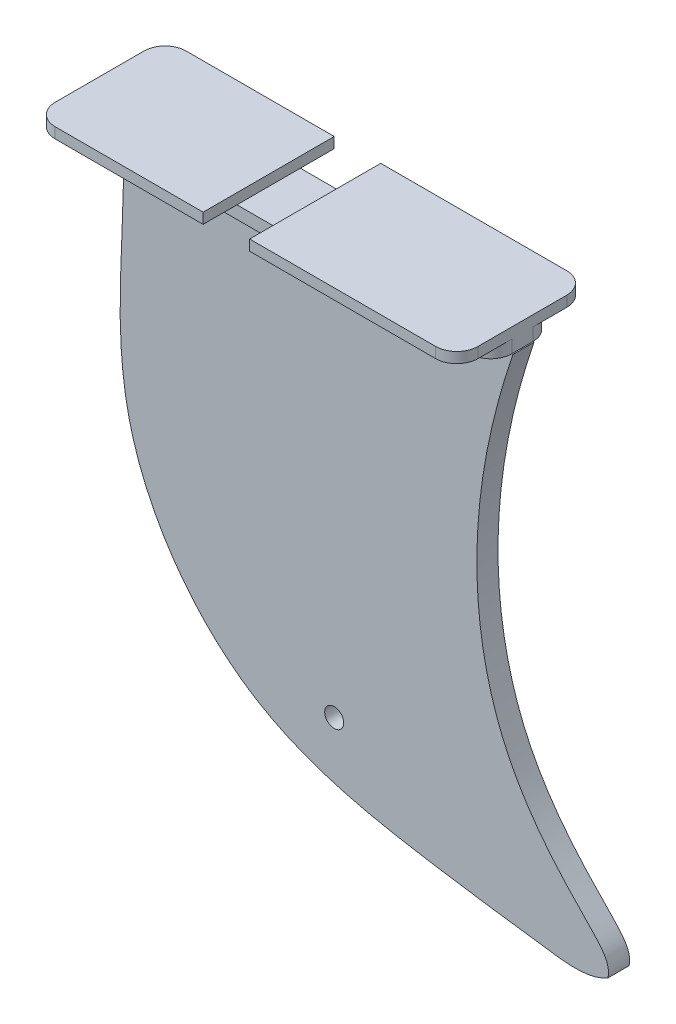
ISO-10303-21;
HEADER;
FILE_DESCRIPTION(('STEP AP214'),'2;1');
FILE_NAME('part.step','',(''),(''),'','','');
FILE_SCHEMA(('AUTOMOTIVE_DESIGN { 1 0 10303 214 1 1 1 1 }'));
ENDSEC;
DATA;
#1=APPLICATION_CONTEXT('core data for automotive mechanical design processes');
#2=APPLICATION_PROTOCOL_DEFINITION('international standard','automotive_design',2000,#1);
#3=PRODUCT_CONTEXT('',#1,'mechanical');
#4=PRODUCT('Part','Part','',(#3));
#5=PRODUCT_RELATED_PRODUCT_CATEGORY('part','',(#4));
#6=PRODUCT_DEFINITION_FORMATION('','',#4);
#7=PRODUCT_DEFINITION_CONTEXT('part definition',#1,'design');
#8=PRODUCT_DEFINITION('design','',#6,#7);
#9=PRODUCT_DEFINITION_SHAPE('','',#8);
#10=(LENGTH_UNIT() NAMED_UNIT(*) SI_UNIT(.MILLI.,.METRE.));
#11=(NAMED_UNIT(*) PLANE_ANGLE_UNIT() SI_UNIT($,.RADIAN.));
#12=(NAMED_UNIT(*) SI_UNIT($,.STERADIAN.) SOLID_ANGLE_UNIT());
#13=UNCERTAINTY_MEASURE_WITH_UNIT(LENGTH_MEASURE(1.E-05),#10,'distance_accuracy_value','');
#14=(GEOMETRIC_REPRESENTATION_CONTEXT(3) GLOBAL_UNCERTAINTY_ASSIGNED_CONTEXT((#13)) GLOBAL_UNIT_ASSIGNED_CONTEXT((#10,
#11,#12)) REPRESENTATION_CONTEXT('',''));
#15=CARTESIAN_POINT('',(0.,0.,0.));
#16=DIRECTION('',(0.,0.,1.));
#17=DIRECTION('',(1.,0.,0.));
#18=AXIS2_PLACEMENT_3D('',#15,#16,#17);
#19=CARTESIAN_POINT('',(-50.,2.5,-15.5));
#20=DIRECTION('',(0.,0.,1.));
#21=DIRECTION('',(1.,0.,0.));
#22=AXIS2_PLACEMENT_3D('',#19,#20,#21);
#23=PLANE('',#22);
#24=DIRECTION('',(-1.,0.,0.));
#25=VECTOR('',#24,1.);
#26=CARTESIAN_POINT('',(-50.,2.5,-15.5));
#27=LINE('',#26,#25);
#28=CARTESIAN_POINT('',(-10.,2.5,-15.5));
#29=VERTEX_POINT('',#28);
#30=CARTESIAN_POINT('',(-45.,2.5,-15.5));
#31=VERTEX_POINT('',#30);
#32=EDGE_CURVE('E222',#29,#31,#27,.T.);
#33=ORIENTED_EDGE('',*,*,#32,.F.);
#34=DIRECTION('',(0.,-1.,0.));
#35=VECTOR('',#34,1.);
#36=CARTESIAN_POINT('',(-10.,2.5,-15.5));
#37=LINE('',#36,#35);
#38=CARTESIAN_POINT('',(-10.,0.,-15.5));
#39=VERTEX_POINT('',#38);
#40=EDGE_CURVE('E205',#29,#39,#37,.T.);
#41=ORIENTED_EDGE('',*,*,#40,.T.);
#42=DIRECTION('',(-1.,0.,0.));
#43=VECTOR('',#42,1.);
#44=CARTESIAN_POINT('',(-50.,0.,-15.5));
#45=LINE('',#44,#43);
#46=CARTESIAN_POINT('',(-45.,0.,-15.5));
#47=VERTEX_POINT('',#46);
#48=EDGE_CURVE('E220',#39,#47,#45,.T.);
#49=ORIENTED_EDGE('',*,*,#48,.T.);
#50=DIRECTION('',(0.,-1.,0.));
#51=VECTOR('',#50,1.);
#52=CARTESIAN_POINT('',(-45.,2.5,-15.5));
#53=LINE('',#52,#51);
#54=EDGE_CURVE('E328',#47,#31,#53,.F.);
#55=ORIENTED_EDGE('',*,*,#54,.T.);
#56=EDGE_LOOP('',(#33,#41,#49,#55));
#57=FACE_BOUND('',#56,.T.);
#58=ADVANCED_FACE('F38',(#57),#23,.F.);
#59=CARTESIAN_POINT('',(-50.,2.5,15.5));
#60=DIRECTION('',(0.,0.,-1.));
#61=DIRECTION('',(-1.,0.,0.));
#62=AXIS2_PLACEMENT_3D('',#59,#60,#61);
#63=PLANE('',#62);
#64=DIRECTION('',(1.,0.,0.));
#65=VECTOR('',#64,1.);
#66=CARTESIAN_POINT('',(-50.,0.,15.5));
#67=LINE('',#66,#65);
#68=CARTESIAN_POINT('',(-45.,0.,15.5));
#69=VERTEX_POINT('',#68);
#70=CARTESIAN_POINT('',(-10.,0.,15.5));
#71=VERTEX_POINT('',#70);
#72=EDGE_CURVE('E248',#69,#71,#67,.T.);
#73=ORIENTED_EDGE('',*,*,#72,.T.);
#74=DIRECTION('',(0.,-1.,0.));
#75=VECTOR('',#74,1.);
#76=CARTESIAN_POINT('',(-10.,2.5,15.5));
#77=LINE('',#76,#75);
#78=CARTESIAN_POINT('',(-10.,2.5,15.5));
#79=VERTEX_POINT('',#78);
#80=EDGE_CURVE('E472',#79,#71,#77,.T.);
#81=ORIENTED_EDGE('',*,*,#80,.F.);
#82=DIRECTION('',(1.,0.,0.));
#83=VECTOR('',#82,1.);
#84=CARTESIAN_POINT('',(-50.,2.5,15.5));
#85=LINE('',#84,#83);
#86=CARTESIAN_POINT('',(-45.,2.5,15.5));
#87=VERTEX_POINT('',#86);
#88=EDGE_CURVE('E257',#87,#79,#85,.T.);
#89=ORIENTED_EDGE('',*,*,#88,.F.);
#90=DIRECTION('',(0.,-1.,0.));
#91=VECTOR('',#90,1.);
#92=CARTESIAN_POINT('',(-45.,2.5,15.5));
#93=LINE('',#92,#91);
#94=EDGE_CURVE('E281',#87,#69,#93,.T.);
#95=ORIENTED_EDGE('',*,*,#94,.T.);
#96=EDGE_LOOP('',(#73,#81,#89,#95));
#97=FACE_BOUND('',#96,.T.);
#98=ADVANCED_FACE('F548',(#97),#63,.F.);
#99=CARTESIAN_POINT('',(0.,2.5,0.));
#100=DIRECTION('',(0.,-1.,0.));
#101=DIRECTION('',(0.,0.,-1.));
#102=AXIS2_PLACEMENT_3D('',#99,#100,#101);
#103=PLANE('',#102);
#104=ORIENTED_EDGE('',*,*,#88,.T.);
#105=DIRECTION('',(0.,0.,1.));
#106=VECTOR('',#105,1.);
#107=CARTESIAN_POINT('',(-10.,2.5,-15.5));
#108=LINE('',#107,#106);
#109=EDGE_CURVE('E477',#29,#79,#108,.T.);
#110=ORIENTED_EDGE('',*,*,#109,.F.);
#111=ORIENTED_EDGE('',*,*,#32,.T.);
#112=CARTESIAN_POINT('',(-45.,2.5,-10.5));
#113=DIRECTION('',(0.,-1.,0.));
#114=DIRECTION('',(0.,0.,-1.));
#115=AXIS2_PLACEMENT_3D('',#112,#113,#114);
#116=CIRCLE('',#115,5.);
#117=CARTESIAN_POINT('',(-50.,2.5,-10.5));
#118=VERTEX_POINT('',#117);
#119=EDGE_CURVE('E292',#31,#118,#116,.F.);
#120=ORIENTED_EDGE('',*,*,#119,.T.);
#121=DIRECTION('',(0.,0.,1.));
#122=VECTOR('',#121,1.);
#123=CARTESIAN_POINT('',(-50.,2.5,15.5));
#124=LINE('',#123,#122);
#125=CARTESIAN_POINT('',(-50.,2.5,10.5));
#126=VERTEX_POINT('',#125);
#127=EDGE_CURVE('E408',#118,#126,#124,.T.);
#128=ORIENTED_EDGE('',*,*,#127,.T.);
#129=CARTESIAN_POINT('',(-45.,2.5,10.5));
#130=DIRECTION('',(0.,-1.,0.));
#131=DIRECTION('',(0.,0.,-1.));
#132=AXIS2_PLACEMENT_3D('',#129,#130,#131);
#133=CIRCLE('',#132,5.);
#134=EDGE_CURVE('E289',#126,#87,#133,.F.);
#135=ORIENTED_EDGE('',*,*,#134,.T.);
#136=EDGE_LOOP('',(#104,#110,#111,#120,#128,#135));
#137=FACE_BOUND('',#136,.T.);
#138=ADVANCED_FACE('F542',(#137),#103,.F.);
#139=CARTESIAN_POINT('',(0.,0.,0.));
#140=DIRECTION('',(0.,-1.,0.));
#141=DIRECTION('',(0.,0.,-1.));
#142=AXIS2_PLACEMENT_3D('',#139,#140,#141);
#143=PLANE('',#142);
#144=DIRECTION('',(0.,0.,1.));
#145=VECTOR('',#144,1.);
#146=CARTESIAN_POINT('',(-10.,0.,-15.5));
#147=LINE('',#146,#145);
#148=CARTESIAN_POINT('',(-10.,0.,7.49999999999999));
#149=VERTEX_POINT('',#148);
#150=EDGE_CURVE('E216',#149,#71,#147,.T.);
#151=ORIENTED_EDGE('',*,*,#150,.T.);
#152=ORIENTED_EDGE('',*,*,#72,.F.);
#153=CARTESIAN_POINT('',(-45.,0.,10.5));
#154=DIRECTION('',(0.,-1.,0.));
#155=DIRECTION('',(0.,0.,-1.));
#156=AXIS2_PLACEMENT_3D('',#153,#154,#155);
#157=CIRCLE('',#156,5.);
#158=CARTESIAN_POINT('',(-50.,0.,10.5));
#159=VERTEX_POINT('',#158);
#160=EDGE_CURVE('E269',#69,#159,#157,.T.);
#161=ORIENTED_EDGE('',*,*,#160,.T.);
#162=DIRECTION('',(0.,0.,1.));
#163=VECTOR('',#162,1.);
#164=CARTESIAN_POINT('',(-50.,0.,15.5));
#165=LINE('',#164,#163);
#166=CARTESIAN_POINT('',(-50.,0.,-10.5));
#167=VERTEX_POINT('',#166);
#168=EDGE_CURVE('E239',#167,#159,#165,.T.);
#169=ORIENTED_EDGE('',*,*,#168,.F.);
#170=CARTESIAN_POINT('',(-45.,0.,-10.5));
#171=DIRECTION('',(0.,-1.,0.));
#172=DIRECTION('',(0.,0.,-1.));
#173=AXIS2_PLACEMENT_3D('',#170,#171,#172);
#174=CIRCLE('',#173,5.);
#175=EDGE_CURVE('E230',#167,#47,#174,.T.);
#176=ORIENTED_EDGE('',*,*,#175,.T.);
#177=ORIENTED_EDGE('',*,*,#48,.F.);
#178=CARTESIAN_POINT('',(-10.,0.,-7.49999999999999));
#179=VERTEX_POINT('',#178);
#180=EDGE_CURVE('E202',#39,#179,#147,.T.);
#181=ORIENTED_EDGE('',*,*,#180,.T.);
#182=DIRECTION('',(1.,0.,0.));
#183=VECTOR('',#182,1.);
#184=CARTESIAN_POINT('',(50.,0.,-7.49999999999999));
#185=LINE('',#184,#183);
#186=CARTESIAN_POINT('',(-37.,0.,-7.5));
#187=VERTEX_POINT('',#186);
#188=EDGE_CURVE('E361',#187,#179,#185,.T.);
#189=ORIENTED_EDGE('',*,*,#188,.F.);
#190=CARTESIAN_POINT('',(-37.,0.,-2.5));
#191=DIRECTION('',(0.,-1.,0.));
#192=DIRECTION('',(0.,0.,-1.));
#193=AXIS2_PLACEMENT_3D('',#190,#191,#192);
#194=CIRCLE('',#193,5.);
#195=CARTESIAN_POINT('',(-42.,0.,-2.5));
#196=VERTEX_POINT('',#195);
#197=EDGE_CURVE('E47',#187,#196,#194,.F.);
#198=ORIENTED_EDGE('',*,*,#197,.T.);
#199=DIRECTION('',(0.,0.,-1.));
#200=VECTOR('',#199,1.);
#201=CARTESIAN_POINT('',(-42.,0.,7.5));
#202=LINE('',#201,#200);
#203=CARTESIAN_POINT('',(-42.,0.,2.5));
#204=VERTEX_POINT('',#203);
#205=EDGE_CURVE('E360',#204,#196,#202,.T.);
#206=ORIENTED_EDGE('',*,*,#205,.F.);
#207=CARTESIAN_POINT('',(-37.,0.,2.5));
#208=DIRECTION('',(0.,-1.,0.));
#209=DIRECTION('',(0.,0.,-1.));
#210=AXIS2_PLACEMENT_3D('',#207,#208,#209);
#211=CIRCLE('',#210,5.);
#212=CARTESIAN_POINT('',(-37.,0.,7.5));
#213=VERTEX_POINT('',#212);
#214=EDGE_CURVE('E11',#204,#213,#211,.F.);
#215=ORIENTED_EDGE('',*,*,#214,.T.);
#216=DIRECTION('',(-1.,0.,0.));
#217=VECTOR('',#216,1.);
#218=CARTESIAN_POINT('',(50.,0.,7.49999999999999));
#219=LINE('',#218,#217);
#220=EDGE_CURVE('E395',#149,#213,#219,.T.);
#221=ORIENTED_EDGE('',*,*,#220,.F.);
#222=EDGE_LOOP('',(#151,#152,#161,#169,#176,#177,#181,#189,#198,#206,#215,#221));
#223=FACE_BOUND('',#222,.T.);
#224=ADVANCED_FACE('F228',(#223),#143,.T.);
#225=DIRECTION('',(0.,0.,1.));
#226=VECTOR('',#225,1.);
#227=CARTESIAN_POINT('',(1.,0.,-15.5));
#228=LINE('',#227,#226);
#229=CARTESIAN_POINT('',(1.,0.,-15.5));
#230=VERTEX_POINT('',#229);
#231=CARTESIAN_POINT('',(1.,0.,-7.49999999999999));
#232=VERTEX_POINT('',#231);
#233=EDGE_CURVE('E54',#230,#232,#228,.T.);
#234=ORIENTED_EDGE('',*,*,#233,.F.);
#235=CARTESIAN_POINT('',(45.,0.,-15.5));
#236=VERTEX_POINT('',#235);
#237=EDGE_CURVE('E233',#236,#230,#45,.T.);
#238=ORIENTED_EDGE('',*,*,#237,.F.);
#239=CARTESIAN_POINT('',(45.,0.,-10.5));
#240=DIRECTION('',(0.,-1.,0.));
#241=DIRECTION('',(0.,0.,-1.));
#242=AXIS2_PLACEMENT_3D('',#239,#240,#241);
#243=CIRCLE('',#242,5.);
#244=CARTESIAN_POINT('',(50.,0.,-10.5));
#245=VERTEX_POINT('',#244);
#246=EDGE_CURVE('E274',#236,#245,#243,.T.);
#247=ORIENTED_EDGE('',*,*,#246,.T.);
#248=DIRECTION('',(0.,0.,-1.));
#249=VECTOR('',#248,1.);
#250=CARTESIAN_POINT('',(50.,0.,15.5));
#251=LINE('',#250,#249);
#252=CARTESIAN_POINT('',(50.,0.,-2.49999999999999));
#253=VERTEX_POINT('',#252);
#254=EDGE_CURVE('E240',#253,#245,#251,.T.);
#255=ORIENTED_EDGE('',*,*,#254,.F.);
#256=CARTESIAN_POINT('',(45.,0.,-2.49999999999999));
#257=DIRECTION('',(0.,-1.,0.));
#258=DIRECTION('',(0.,0.,-1.));
#259=AXIS2_PLACEMENT_3D('',#256,#257,#258);
#260=CIRCLE('',#259,5.);
#261=CARTESIAN_POINT('',(45.,0.,-7.49999999999999));
#262=VERTEX_POINT('',#261);
#263=EDGE_CURVE('E354',#253,#262,#260,.F.);
#264=ORIENTED_EDGE('',*,*,#263,.T.);
#265=EDGE_CURVE('E371',#232,#262,#185,.T.);
#266=ORIENTED_EDGE('',*,*,#265,.F.);
#267=EDGE_LOOP('',(#234,#238,#247,#255,#264,#266));
#268=FACE_BOUND('',#267,.T.);
#269=ADVANCED_FACE('F456',(#268),#143,.T.);
#270=CARTESIAN_POINT('',(0.,-3.,0.));
#271=DIRECTION('',(0.,1.,0.));
#272=DIRECTION('',(0.,0.,1.));
#273=AXIS2_PLACEMENT_3D('',#270,#271,#272);
#274=PLANE('',#273);
#275=DIRECTION('',(-1.,0.,0.));
#276=VECTOR('',#275,1.);
#277=CARTESIAN_POINT('',(50.2686737770654,-3.,2.5));
#278=LINE('',#277,#276);
#279=CARTESIAN_POINT('',(50.,-3.,2.5));
#280=VERTEX_POINT('',#279);
#281=CARTESIAN_POINT('',(-42.,-3.00000000000001,2.5));
#282=VERTEX_POINT('',#281);
#283=EDGE_CURVE('E513',#280,#282,#278,.T.);
#284=ORIENTED_EDGE('',*,*,#283,.F.);
#285=CARTESIAN_POINT('',(45.,-3.,2.49999999999999));
#286=DIRECTION('',(0.,1.,0.));
#287=DIRECTION('',(0.,0.,1.));
#288=AXIS2_PLACEMENT_3D('',#285,#286,#287);
#289=CIRCLE('',#288,5.);
#290=CARTESIAN_POINT('',(45.,-3.,7.49999999999999));
#291=VERTEX_POINT('',#290);
#292=EDGE_CURVE('E319',#280,#291,#289,.F.);
#293=ORIENTED_EDGE('',*,*,#292,.T.);
#294=DIRECTION('',(-1.,0.,0.));
#295=VECTOR('',#294,1.);
#296=CARTESIAN_POINT('',(50.,-3.,7.49999999999999));
#297=LINE('',#296,#295);
#298=CARTESIAN_POINT('',(-37.,-3.,7.5));
#299=VERTEX_POINT('',#298);
#300=EDGE_CURVE('E389',#291,#299,#297,.T.);
#301=ORIENTED_EDGE('',*,*,#300,.T.);
#302=CARTESIAN_POINT('',(-37.,-3.,2.5));
#303=DIRECTION('',(0.,1.,0.));
#304=DIRECTION('',(0.,0.,1.));
#305=AXIS2_PLACEMENT_3D('',#302,#303,#304);
#306=CIRCLE('',#305,5.);
#307=EDGE_CURVE('E308',#299,#282,#306,.F.);
#308=ORIENTED_EDGE('',*,*,#307,.T.);
#309=EDGE_LOOP('',(#284,#293,#301,#308));
#310=FACE_BOUND('',#309,.T.);
#311=ADVANCED_FACE('F531',(#310),#274,.F.);
#312=CARTESIAN_POINT('',(50.,2.5,15.5));
#313=DIRECTION('',(-1.,0.,0.));
#314=DIRECTION('',(0.,0.,1.));
#315=AXIS2_PLACEMENT_3D('',#312,#313,#314);
#316=PLANE('',#315);
#317=DIRECTION('',(0.,0.,-1.));
#318=VECTOR('',#317,1.);
#319=CARTESIAN_POINT('',(50.,2.5,15.5));
#320=LINE('',#319,#318);
#321=CARTESIAN_POINT('',(50.,2.5,10.5));
#322=VERTEX_POINT('',#321);
#323=CARTESIAN_POINT('',(50.,2.5,-10.5));
#324=VERTEX_POINT('',#323);
#325=EDGE_CURVE('E252',#322,#324,#320,.T.);
#326=ORIENTED_EDGE('',*,*,#325,.F.);
#327=DIRECTION('',(0.,-1.,0.));
#328=VECTOR('',#327,1.);
#329=CARTESIAN_POINT('',(50.,2.5,10.5));
#330=LINE('',#329,#328);
#331=CARTESIAN_POINT('',(50.,0.,10.5));
#332=VERTEX_POINT('',#331);
#333=EDGE_CURVE('E265',#322,#332,#330,.T.);
#334=ORIENTED_EDGE('',*,*,#333,.T.);
#335=CARTESIAN_POINT('',(50.,0.,2.49999999999999));
#336=VERTEX_POINT('',#335);
#337=EDGE_CURVE('E234',#332,#336,#251,.T.);
#338=ORIENTED_EDGE('',*,*,#337,.T.);
#339=DIRECTION('',(0.,1.,0.));
#340=VECTOR('',#339,1.);
#341=CARTESIAN_POINT('',(50.,2.5,2.49999999999999));
#342=LINE('',#341,#340);
#343=EDGE_CURVE('E261',#336,#280,#342,.F.);
#344=ORIENTED_EDGE('',*,*,#343,.T.);
#345=DIRECTION('',(0.,0.,1.));
#346=VECTOR('',#345,1.);
#347=CARTESIAN_POINT('',(50.,-3.,7.49999999999999));
#348=LINE('',#347,#346);
#349=CARTESIAN_POINT('',(50.,-3.,-2.5));
#350=VERTEX_POINT('',#349);
#351=EDGE_CURVE('E399',#350,#280,#348,.T.);
#352=ORIENTED_EDGE('',*,*,#351,.F.);
#353=DIRECTION('',(0.,1.,0.));
#354=VECTOR('',#353,1.);
#355=CARTESIAN_POINT('',(50.,2.5,-2.49999999999999));
#356=LINE('',#355,#354);
#357=EDGE_CURVE('E256',#350,#253,#356,.T.);
#358=ORIENTED_EDGE('',*,*,#357,.T.);
#359=ORIENTED_EDGE('',*,*,#254,.T.);
#360=DIRECTION('',(0.,-1.,0.));
#361=VECTOR('',#360,1.);
#362=CARTESIAN_POINT('',(50.,2.5,-10.5));
#363=LINE('',#362,#361);
#364=EDGE_CURVE('E253',#245,#324,#363,.F.);
#365=ORIENTED_EDGE('',*,*,#364,.T.);
#366=EDGE_LOOP('',(#326,#334,#338,#344,#352,#358,#359,#365));
#367=FACE_BOUND('',#366,.T.);
#368=ADVANCED_FACE('F434',(#367),#316,.F.);
#369=ORIENTED_EDGE('',*,*,#237,.T.);
#370=DIRECTION('',(0.,1.,0.));
#371=VECTOR('',#370,1.);
#372=CARTESIAN_POINT('',(0.999999999999997,2.5,-15.5));
#373=LINE('',#372,#371);
#374=CARTESIAN_POINT('',(0.999999999999997,2.5,-15.5));
#375=VERTEX_POINT('',#374);
#376=EDGE_CURVE('E224',#230,#375,#373,.T.);
#377=ORIENTED_EDGE('',*,*,#376,.T.);
#378=CARTESIAN_POINT('',(45.,2.5,-15.5));
#379=VERTEX_POINT('',#378);
#380=EDGE_CURVE('E404',#379,#375,#27,.T.);
#381=ORIENTED_EDGE('',*,*,#380,.F.);
#382=DIRECTION('',(0.,-1.,0.));
#383=VECTOR('',#382,1.);
#384=CARTESIAN_POINT('',(45.,2.5,-15.5));
#385=LINE('',#384,#383);
#386=EDGE_CURVE('E331',#379,#236,#385,.T.);
#387=ORIENTED_EDGE('',*,*,#386,.T.);
#388=EDGE_LOOP('',(#369,#377,#381,#387));
#389=FACE_BOUND('',#388,.T.);
#390=ADVANCED_FACE('F467',(#389),#23,.F.);
#391=CARTESIAN_POINT('',(-50.,2.5,15.5));
#392=DIRECTION('',(1.,0.,0.));
#393=DIRECTION('',(0.,0.,-1.));
#394=AXIS2_PLACEMENT_3D('',#391,#392,#393);
#395=PLANE('',#394);
#396=ORIENTED_EDGE('',*,*,#127,.F.);
#397=DIRECTION('',(0.,-1.,0.));
#398=VECTOR('',#397,1.);
#399=CARTESIAN_POINT('',(-50.,2.5,-10.5));
#400=LINE('',#399,#398);
#401=EDGE_CURVE('E338',#118,#167,#400,.T.);
#402=ORIENTED_EDGE('',*,*,#401,.T.);
#403=ORIENTED_EDGE('',*,*,#168,.T.);
#404=DIRECTION('',(0.,-1.,0.));
#405=VECTOR('',#404,1.);
#406=CARTESIAN_POINT('',(-50.,2.5,10.5));
#407=LINE('',#406,#405);
#408=EDGE_CURVE('E335',#159,#126,#407,.F.);
#409=ORIENTED_EDGE('',*,*,#408,.T.);
#410=EDGE_LOOP('',(#396,#402,#403,#409));
#411=FACE_BOUND('',#410,.T.);
#412=ADVANCED_FACE('F547',(#411),#395,.F.);
#413=CARTESIAN_POINT('',(0.999999999999997,2.5,15.5));
#414=VERTEX_POINT('',#413);
#415=CARTESIAN_POINT('',(45.,2.5,15.5));
#416=VERTEX_POINT('',#415);
#417=EDGE_CURVE('E411',#414,#416,#85,.T.);
#418=ORIENTED_EDGE('',*,*,#417,.F.);
#419=DIRECTION('',(0.,1.,0.));
#420=VECTOR('',#419,1.);
#421=CARTESIAN_POINT('',(0.999999999999997,2.5,15.5));
#422=LINE('',#421,#420);
#423=CARTESIAN_POINT('',(1.,0.,15.5));
#424=VERTEX_POINT('',#423);
#425=EDGE_CURVE('E225',#424,#414,#422,.T.);
#426=ORIENTED_EDGE('',*,*,#425,.F.);
#427=CARTESIAN_POINT('',(45.,0.,15.5));
#428=VERTEX_POINT('',#427);
#429=EDGE_CURVE('E247',#424,#428,#67,.T.);
#430=ORIENTED_EDGE('',*,*,#429,.T.);
#431=DIRECTION('',(0.,-1.,0.));
#432=VECTOR('',#431,1.);
#433=CARTESIAN_POINT('',(45.,2.5,15.5));
#434=LINE('',#433,#432);
#435=EDGE_CURVE('E285',#428,#416,#434,.F.);
#436=ORIENTED_EDGE('',*,*,#435,.T.);
#437=EDGE_LOOP('',(#418,#426,#430,#436));
#438=FACE_BOUND('',#437,.T.);
#439=ADVANCED_FACE('F427',(#438),#63,.F.);
#440=ORIENTED_EDGE('',*,*,#380,.T.);
#441=DIRECTION('',(0.,0.,1.));
#442=VECTOR('',#441,1.);
#443=CARTESIAN_POINT('',(0.999999999999997,2.5,-15.5));
#444=LINE('',#443,#442);
#445=EDGE_CURVE('E423',#375,#414,#444,.T.);
#446=ORIENTED_EDGE('',*,*,#445,.T.);
#447=ORIENTED_EDGE('',*,*,#417,.T.);
#448=CARTESIAN_POINT('',(45.,2.5,10.5));
#449=DIRECTION('',(0.,-1.,0.));
#450=DIRECTION('',(0.,0.,-1.));
#451=AXIS2_PLACEMENT_3D('',#448,#449,#450);
#452=CIRCLE('',#451,5.);
#453=EDGE_CURVE('E298',#416,#322,#452,.F.);
#454=ORIENTED_EDGE('',*,*,#453,.T.);
#455=ORIENTED_EDGE('',*,*,#325,.T.);
#456=CARTESIAN_POINT('',(45.,2.5,-10.5));
#457=DIRECTION('',(0.,-1.,0.));
#458=DIRECTION('',(0.,0.,-1.));
#459=AXIS2_PLACEMENT_3D('',#456,#457,#458);
#460=CIRCLE('',#459,5.);
#461=EDGE_CURVE('E295',#324,#379,#460,.F.);
#462=ORIENTED_EDGE('',*,*,#461,.T.);
#463=EDGE_LOOP('',(#440,#446,#447,#454,#455,#462));
#464=FACE_BOUND('',#463,.T.);
#465=ADVANCED_FACE('F420',(#464),#103,.F.);
#466=CARTESIAN_POINT('',(1.,0.,7.49999999999999));
#467=VERTEX_POINT('',#466);
#468=EDGE_CURVE('E214',#467,#424,#228,.T.);
#469=ORIENTED_EDGE('',*,*,#468,.F.);
#470=CARTESIAN_POINT('',(45.,0.,7.49999999999999));
#471=VERTEX_POINT('',#470);
#472=EDGE_CURVE('E372',#471,#467,#219,.T.);
#473=ORIENTED_EDGE('',*,*,#472,.F.);
#474=CARTESIAN_POINT('',(45.,0.,2.49999999999999));
#475=DIRECTION('',(0.,-1.,0.));
#476=DIRECTION('',(0.,0.,-1.));
#477=AXIS2_PLACEMENT_3D('',#474,#475,#476);
#478=CIRCLE('',#477,5.);
#479=EDGE_CURVE('E350',#471,#336,#478,.F.);
#480=ORIENTED_EDGE('',*,*,#479,.T.);
#481=ORIENTED_EDGE('',*,*,#337,.F.);
#482=CARTESIAN_POINT('',(45.,0.,10.5));
#483=DIRECTION('',(0.,-1.,0.));
#484=DIRECTION('',(0.,0.,-1.));
#485=AXIS2_PLACEMENT_3D('',#482,#483,#484);
#486=CIRCLE('',#485,5.);
#487=EDGE_CURVE('E277',#332,#428,#486,.T.);
#488=ORIENTED_EDGE('',*,*,#487,.T.);
#489=ORIENTED_EDGE('',*,*,#429,.F.);
#490=EDGE_LOOP('',(#469,#473,#480,#481,#488,#489));
#491=FACE_BOUND('',#490,.T.);
#492=ADVANCED_FACE('F437',(#491),#143,.T.);
#493=CARTESIAN_POINT('',(50.,-3.,7.49999999999999));
#494=DIRECTION('',(0.,0.,-1.));
#495=DIRECTION('',(-1.,0.,0.));
#496=AXIS2_PLACEMENT_3D('',#493,#494,#495);
#497=PLANE('',#496);
#498=ORIENTED_EDGE('',*,*,#300,.F.);
#499=DIRECTION('',(0.,1.,0.));
#500=VECTOR('',#499,1.);
#501=CARTESIAN_POINT('',(45.,-3.,7.49999999999999));
#502=LINE('',#501,#500);
#503=EDGE_CURVE('E304',#291,#471,#502,.T.);
#504=ORIENTED_EDGE('',*,*,#503,.T.);
#505=ORIENTED_EDGE('',*,*,#472,.T.);
#506=DIRECTION('',(-1.,0.,0.));
#507=VECTOR('',#506,1.);
#508=CARTESIAN_POINT('',(50.,0.,7.49999999999999));
#509=LINE('',#508,#507);
#510=EDGE_CURVE('E480',#467,#149,#509,.T.);
#511=ORIENTED_EDGE('',*,*,#510,.T.);
#512=ORIENTED_EDGE('',*,*,#220,.T.);
#513=DIRECTION('',(0.,1.,0.));
#514=VECTOR('',#513,1.);
#515=CARTESIAN_POINT('',(-37.,-3.,7.5));
#516=LINE('',#515,#514);
#517=EDGE_CURVE('E301',#213,#299,#516,.F.);
#518=ORIENTED_EDGE('',*,*,#517,.T.);
#519=EDGE_LOOP('',(#498,#504,#505,#511,#512,#518));
#520=FACE_BOUND('',#519,.T.);
#521=ADVANCED_FACE('F536',(#520),#497,.F.);
#522=CARTESIAN_POINT('',(-42.,-3.,7.5));
#523=DIRECTION('',(1.,0.,0.));
#524=DIRECTION('',(0.,0.,-1.));
#525=AXIS2_PLACEMENT_3D('',#522,#523,#524);
#526=PLANE('',#525);
#527=ORIENTED_EDGE('',*,*,#205,.T.);
#528=DIRECTION('',(0.,1.,0.));
#529=VECTOR('',#528,1.);
#530=CARTESIAN_POINT('',(-42.,-3.,-2.5));
#531=LINE('',#530,#529);
#532=CARTESIAN_POINT('',(-42.,-3.,-2.5));
#533=VERTEX_POINT('',#532);
#534=EDGE_CURVE('E346',#196,#533,#531,.F.);
#535=ORIENTED_EDGE('',*,*,#534,.T.);
#536=DIRECTION('',(0.,0.,-1.));
#537=VECTOR('',#536,1.);
#538=CARTESIAN_POINT('',(-42.,-3.,7.5));
#539=LINE('',#538,#537);
#540=EDGE_CURVE('E383',#282,#533,#539,.T.);
#541=ORIENTED_EDGE('',*,*,#540,.F.);
#542=DIRECTION('',(0.,1.,0.));
#543=VECTOR('',#542,1.);
#544=CARTESIAN_POINT('',(-42.,-3.,2.5));
#545=LINE('',#544,#543);
#546=EDGE_CURVE('E342',#282,#204,#545,.T.);
#547=ORIENTED_EDGE('',*,*,#546,.T.);
#548=EDGE_LOOP('',(#527,#535,#541,#547));
#549=FACE_BOUND('',#548,.T.);
#550=ADVANCED_FACE('F366',(#549),#526,.F.);
#551=CARTESIAN_POINT('',(50.,-3.,-7.49999999999999));
#552=DIRECTION('',(0.,0.,1.));
#553=DIRECTION('',(1.,0.,0.));
#554=AXIS2_PLACEMENT_3D('',#551,#552,#553);
#555=PLANE('',#554);
#556=ORIENTED_EDGE('',*,*,#188,.T.);
#557=EDGE_CURVE('E400',#179,#232,#185,.T.);
#558=ORIENTED_EDGE('',*,*,#557,.T.);
#559=ORIENTED_EDGE('',*,*,#265,.T.);
#560=DIRECTION('',(0.,1.,0.));
#561=VECTOR('',#560,1.);
#562=CARTESIAN_POINT('',(45.,-3.,-7.49999999999999));
#563=LINE('',#562,#561);
#564=CARTESIAN_POINT('',(45.,-3.,-7.49999999999999));
#565=VERTEX_POINT('',#564);
#566=EDGE_CURVE('E62',#262,#565,#563,.F.);
#567=ORIENTED_EDGE('',*,*,#566,.T.);
#568=DIRECTION('',(1.,0.,0.));
#569=VECTOR('',#568,1.);
#570=CARTESIAN_POINT('',(50.,-3.,-7.49999999999999));
#571=LINE('',#570,#569);
#572=CARTESIAN_POINT('',(-37.,-3.,-7.5));
#573=VERTEX_POINT('',#572);
#574=EDGE_CURVE('E378',#573,#565,#571,.T.);
#575=ORIENTED_EDGE('',*,*,#574,.F.);
#576=DIRECTION('',(0.,1.,0.));
#577=VECTOR('',#576,1.);
#578=CARTESIAN_POINT('',(-37.,-3.,-7.5));
#579=LINE('',#578,#577);
#580=EDGE_CURVE('E322',#573,#187,#579,.T.);
#581=ORIENTED_EDGE('',*,*,#580,.T.);
#582=EDGE_LOOP('',(#556,#558,#559,#567,#575,#581));
#583=FACE_BOUND('',#582,.T.);
#584=ADVANCED_FACE('F381',(#583),#555,.F.);
#585=CARTESIAN_POINT('',(45.,-3.,-2.49999999999999));
#586=DIRECTION('',(0.,1.,0.));
#587=DIRECTION('',(0.,0.,1.));
#588=AXIS2_PLACEMENT_3D('',#585,#586,#587);
#589=CIRCLE('',#588,5.);
#590=EDGE_CURVE('E315',#565,#350,#589,.F.);
#591=ORIENTED_EDGE('',*,*,#590,.T.);
#592=DIRECTION('',(-1.,0.,0.));
#593=VECTOR('',#592,1.);
#594=CARTESIAN_POINT('',(50.2686737770654,-3.,-2.5));
#595=LINE('',#594,#593);
#596=EDGE_CURVE('E380',#350,#533,#595,.T.);
#597=ORIENTED_EDGE('',*,*,#596,.T.);
#598=CARTESIAN_POINT('',(-37.,-3.,-2.5));
#599=DIRECTION('',(0.,1.,0.));
#600=DIRECTION('',(0.,0.,1.));
#601=AXIS2_PLACEMENT_3D('',#598,#599,#600);
#602=CIRCLE('',#601,5.);
#603=EDGE_CURVE('E312',#533,#573,#602,.F.);
#604=ORIENTED_EDGE('',*,*,#603,.T.);
#605=ORIENTED_EDGE('',*,*,#574,.T.);
#606=EDGE_LOOP('',(#591,#597,#604,#605));
#607=FACE_BOUND('',#606,.T.);
#608=ADVANCED_FACE('F377',(#607),#274,.F.);
#609=CARTESIAN_POINT('',(45.,2.5,10.5));
#610=DIRECTION('',(0.,-1.,0.));
#611=DIRECTION('',(0.,0.,-1.));
#612=AXIS2_PLACEMENT_3D('',#609,#610,#611);
#613=CYLINDRICAL_SURFACE('',#612,5.);
#614=ORIENTED_EDGE('',*,*,#453,.F.);
#615=ORIENTED_EDGE('',*,*,#435,.F.);
#616=ORIENTED_EDGE('',*,*,#487,.F.);
#617=ORIENTED_EDGE('',*,*,#333,.F.);
#618=EDGE_LOOP('',(#614,#615,#616,#617));
#619=FACE_BOUND('',#618,.T.);
#620=ADVANCED_FACE('F431',(#619),#613,.T.);
#621=CARTESIAN_POINT('',(45.,-3.,2.49999999999999));
#622=DIRECTION('',(0.,1.,0.));
#623=DIRECTION('',(0.,0.,1.));
#624=AXIS2_PLACEMENT_3D('',#621,#622,#623);
#625=CYLINDRICAL_SURFACE('',#624,5.);
#626=ORIENTED_EDGE('',*,*,#292,.F.);
#627=ORIENTED_EDGE('',*,*,#343,.F.);
#628=ORIENTED_EDGE('',*,*,#479,.F.);
#629=ORIENTED_EDGE('',*,*,#503,.F.);
#630=EDGE_LOOP('',(#626,#627,#628,#629));
#631=FACE_BOUND('',#630,.T.);
#632=ADVANCED_FACE('F443',(#631),#625,.T.);
#633=CARTESIAN_POINT('',(45.,2.5,-2.49999999999999));
#634=DIRECTION('',(0.,1.,0.));
#635=DIRECTION('',(0.,0.,1.));
#636=AXIS2_PLACEMENT_3D('',#633,#634,#635);
#637=CYLINDRICAL_SURFACE('',#636,5.);
#638=ORIENTED_EDGE('',*,*,#590,.F.);
#639=ORIENTED_EDGE('',*,*,#566,.F.);
#640=ORIENTED_EDGE('',*,*,#263,.F.);
#641=ORIENTED_EDGE('',*,*,#357,.F.);
#642=EDGE_LOOP('',(#638,#639,#640,#641));
#643=FACE_BOUND('',#642,.T.);
#644=ADVANCED_FACE('F453',(#643),#637,.T.);
#645=CARTESIAN_POINT('',(45.,2.5,-10.5));
#646=DIRECTION('',(0.,-1.,0.));
#647=DIRECTION('',(0.,0.,-1.));
#648=AXIS2_PLACEMENT_3D('',#645,#646,#647);
#649=CYLINDRICAL_SURFACE('',#648,5.);
#650=ORIENTED_EDGE('',*,*,#461,.F.);
#651=ORIENTED_EDGE('',*,*,#364,.F.);
#652=ORIENTED_EDGE('',*,*,#246,.F.);
#653=ORIENTED_EDGE('',*,*,#386,.F.);
#654=EDGE_LOOP('',(#650,#651,#652,#653));
#655=FACE_BOUND('',#654,.T.);
#656=ADVANCED_FACE('F462',(#655),#649,.T.);
#657=CARTESIAN_POINT('',(-45.,2.5,-10.5));
#658=DIRECTION('',(0.,-1.,0.));
#659=DIRECTION('',(0.,0.,-1.));
#660=AXIS2_PLACEMENT_3D('',#657,#658,#659);
#661=CYLINDRICAL_SURFACE('',#660,5.);
#662=ORIENTED_EDGE('',*,*,#119,.F.);
#663=ORIENTED_EDGE('',*,*,#54,.F.);
#664=ORIENTED_EDGE('',*,*,#175,.F.);
#665=ORIENTED_EDGE('',*,*,#401,.F.);
#666=EDGE_LOOP('',(#662,#663,#664,#665));
#667=FACE_BOUND('',#666,.T.);
#668=ADVANCED_FACE('F564',(#667),#661,.T.);
#669=CARTESIAN_POINT('',(-37.,-3.,-2.5));
#670=DIRECTION('',(0.,1.,0.));
#671=DIRECTION('',(0.,0.,1.));
#672=AXIS2_PLACEMENT_3D('',#669,#670,#671);
#673=CYLINDRICAL_SURFACE('',#672,5.);
#674=ORIENTED_EDGE('',*,*,#603,.F.);
#675=ORIENTED_EDGE('',*,*,#534,.F.);
#676=ORIENTED_EDGE('',*,*,#197,.F.);
#677=ORIENTED_EDGE('',*,*,#580,.F.);
#678=EDGE_LOOP('',(#674,#675,#676,#677));
#679=FACE_BOUND('',#678,.T.);
#680=ADVANCED_FACE('F374',(#679),#673,.T.);
#681=CARTESIAN_POINT('',(-37.,-3.,2.5));
#682=DIRECTION('',(0.,1.,0.));
#683=DIRECTION('',(0.,0.,1.));
#684=AXIS2_PLACEMENT_3D('',#681,#682,#683);
#685=CYLINDRICAL_SURFACE('',#684,5.);
#686=ORIENTED_EDGE('',*,*,#307,.F.);
#687=ORIENTED_EDGE('',*,*,#517,.F.);
#688=ORIENTED_EDGE('',*,*,#214,.F.);
#689=ORIENTED_EDGE('',*,*,#546,.F.);
#690=EDGE_LOOP('',(#686,#687,#688,#689));
#691=FACE_BOUND('',#690,.T.);
#692=ADVANCED_FACE('F569',(#691),#685,.T.);
#693=CARTESIAN_POINT('',(-45.,2.5,10.5));
#694=DIRECTION('',(0.,-1.,0.));
#695=DIRECTION('',(0.,0.,-1.));
#696=AXIS2_PLACEMENT_3D('',#693,#694,#695);
#697=CYLINDRICAL_SURFACE('',#696,5.);
#698=ORIENTED_EDGE('',*,*,#134,.F.);
#699=ORIENTED_EDGE('',*,*,#408,.F.);
#700=ORIENTED_EDGE('',*,*,#160,.F.);
#701=ORIENTED_EDGE('',*,*,#94,.F.);
#702=EDGE_LOOP('',(#698,#699,#700,#701));
#703=FACE_BOUND('',#702,.T.);
#704=ADVANCED_FACE('F40',(#703),#697,.T.);
#705=CARTESIAN_POINT('',(50.2686737770654,-3.,2.5));
#706=DIRECTION('',(0.,-1.,0.));
#707=DIRECTION('',(1.,0.,0.));
#708=AXIS2_PLACEMENT_3D('',#705,#706,#707);
#709=PLANE('',#708);
#710=CARTESIAN_POINT('',(50.2686737770654,-3.,-2.5));
#711=VERTEX_POINT('',#710);
#712=EDGE_CURVE('E600',#711,#350,#595,.T.);
#713=ORIENTED_EDGE('',*,*,#712,.T.);
#714=ORIENTED_EDGE('',*,*,#351,.T.);
#715=CARTESIAN_POINT('',(50.2686737770654,-3.,2.5));
#716=VERTEX_POINT('',#715);
#717=EDGE_CURVE('E515',#716,#280,#278,.T.);
#718=ORIENTED_EDGE('',*,*,#717,.F.);
#719=DIRECTION('',(0.,0.,-1.));
#720=VECTOR('',#719,1.);
#721=CARTESIAN_POINT('',(50.2686737770654,-3.,2.5));
#722=LINE('',#721,#720);
#723=EDGE_CURVE('E612',#716,#711,#722,.T.);
#724=ORIENTED_EDGE('',*,*,#723,.T.);
#725=EDGE_LOOP('',(#713,#714,#718,#724));
#726=FACE_BOUND('',#725,.T.);
#727=ADVANCED_FACE('F526',(#726),#709,.F.);
#728=CARTESIAN_POINT('',(72.7453190562339,-119.45797853805,2.5));
#729=CARTESIAN_POINT('',(73.5272978003636,-115.295050347708,2.5));
#730=CARTESIAN_POINT('',(67.8663834720424,-111.564174062994,2.5));
#731=CARTESIAN_POINT('',(40.8374136293946,-79.6561025630625,2.5));
#732=CARTESIAN_POINT('',(38.369873507686,-37.7895082874847,2.5));
#733=CARTESIAN_POINT('',(50.2686737770656,-2.9999999999996,2.5));
#734=B_SPLINE_CURVE_WITH_KNOTS('',3,(#728,#729,#730,#731,#732,#733),.UNSPECIFIED.,.F.,.F.,(4,1,
1,4),(0.,0.326988998162601,0.554852247940817,1.),.UNSPECIFIED.);
#735=DIRECTION('',(0.,0.,-1.));
#736=VECTOR('',#735,1.);
#737=SURFACE_OF_LINEAR_EXTRUSION('',#734,#736);
#738=CARTESIAN_POINT('',(72.7453190562339,-119.45797853805,-2.5));
#739=CARTESIAN_POINT('',(73.5272978003636,-115.295050347708,-2.5));
#740=CARTESIAN_POINT('',(67.8663834720424,-111.564174062994,-2.5));
#741=CARTESIAN_POINT('',(40.8374136293946,-79.6561025630625,-2.5));
#742=CARTESIAN_POINT('',(38.369873507686,-37.7895082874847,-2.5));
#743=CARTESIAN_POINT('',(50.2686737770656,-2.9999999999996,-2.5));
#744=B_SPLINE_CURVE_WITH_KNOTS('',3,(#738,#739,#740,#741,#742,#743),.UNSPECIFIED.,.F.,.F.,(4,1,
1,4),(0.,0.326988998162601,0.554852247940817,1.),.UNSPECIFIED.);
#745=CARTESIAN_POINT('',(72.7453190562339,-119.45797853805,-2.5));
#746=VERTEX_POINT('',#745);
#747=EDGE_CURVE('E494',#746,#711,#744,.T.);
#748=ORIENTED_EDGE('',*,*,#747,.T.);
#749=ORIENTED_EDGE('',*,*,#723,.F.);
#750=CARTESIAN_POINT('',(72.7453190562339,-119.45797853805,2.5));
#751=VERTEX_POINT('',#750);
#752=EDGE_CURVE('E506',#751,#716,#734,.T.);
#753=ORIENTED_EDGE('',*,*,#752,.F.);
#754=DIRECTION('',(0.,0.,-1.));
#755=VECTOR('',#754,1.);
#756=CARTESIAN_POINT('',(72.7453190562339,-119.45797853805,2.5));
#757=LINE('',#756,#755);
#758=EDGE_CURVE('E609',#751,#746,#757,.T.);
#759=ORIENTED_EDGE('',*,*,#758,.T.);
#760=EDGE_LOOP('',(#748,#749,#753,#759));
#761=FACE_BOUND('',#760,.T.);
#762=ADVANCED_FACE('F521',(#761),#737,.F.);
#763=CARTESIAN_POINT('',(-42.,-3.,2.5));
#764=CARTESIAN_POINT('',(-40.9085130635637,-23.2942870696618,2.5));
#765=CARTESIAN_POINT('',(-48.7762785630255,-61.4392414921328,2.5));
#766=CARTESIAN_POINT('',(-15.0116129030552,-108.496757752683,2.5));
#767=CARTESIAN_POINT('',(26.0912809830065,-116.271998862179,2.5));
#768=CARTESIAN_POINT('',(53.9217447207977,-120.172870923581,2.5));
#769=CARTESIAN_POINT('',(68.3309722556653,-122.076661228524,2.5));
#770=CARTESIAN_POINT('',(72.7453190562339,-119.45797853805,2.5));
#771=B_SPLINE_CURVE_WITH_KNOTS('',3,(#763,#764,#765,#766,#767,#768,#769,#770),.UNSPECIFIED.,.F.,
.F.,(4,1,1,1,1,4),(0.,0.313172426000175,0.56068679091605,0.787562365297058,0.924725025907323,
1.),.UNSPECIFIED.);
#772=DIRECTION('',(0.,0.,-1.));
#773=VECTOR('',#772,1.);
#774=SURFACE_OF_LINEAR_EXTRUSION('',#771,#773);
#775=CARTESIAN_POINT('',(-42.,-3.,-2.5));
#776=CARTESIAN_POINT('',(-40.9085130635637,-23.2942870696618,-2.5));
#777=CARTESIAN_POINT('',(-48.7762785630255,-61.4392414921328,-2.5));
#778=CARTESIAN_POINT('',(-15.0116129030552,-108.496757752683,-2.5));
#779=CARTESIAN_POINT('',(26.0912809830065,-116.271998862179,-2.5));
#780=CARTESIAN_POINT('',(53.9217447207977,-120.172870923581,-2.5));
#781=CARTESIAN_POINT('',(68.3309722556653,-122.076661228524,-2.5));
#782=CARTESIAN_POINT('',(72.7453190562339,-119.45797853805,-2.5));
#783=B_SPLINE_CURVE_WITH_KNOTS('',3,(#775,#776,#777,#778,#779,#780,#781,#782),.UNSPECIFIED.,.F.,
.F.,(4,1,1,1,1,4),(0.,0.313172426000175,0.56068679091605,0.787562365297058,0.924725025907323,
1.),.UNSPECIFIED.);
#784=EDGE_CURVE('E514',#533,#746,#783,.T.);
#785=ORIENTED_EDGE('',*,*,#784,.T.);
#786=ORIENTED_EDGE('',*,*,#758,.F.);
#787=EDGE_CURVE('E607',#282,#751,#771,.T.);
#788=ORIENTED_EDGE('',*,*,#787,.F.);
#789=ORIENTED_EDGE('',*,*,#540,.T.);
#790=EDGE_LOOP('',(#785,#786,#788,#789));
#791=FACE_BOUND('',#790,.T.);
#792=ADVANCED_FACE('F525',(#791),#774,.F.);
#793=CARTESIAN_POINT('',(51.9251663857917,-90.7838361717918,2.5));
#794=DIRECTION('',(0.,0.,-1.));
#795=DIRECTION('',(-1.,0.,0.));
#796=AXIS2_PLACEMENT_3D('',#793,#794,#795);
#797=PLANE('',#796);
#798=CARTESIAN_POINT('',(8.,-8.5,2.5));
#799=DIRECTION('',(0.,0.,1.));
#800=DIRECTION('',(1.,0.,0.));
#801=AXIS2_PLACEMENT_3D('',#798,#799,#800);
#802=CIRCLE('',#801,2.25);
#803=CARTESIAN_POINT('',(10.25,-8.5,2.5));
#804=VERTEX_POINT('',#803);
#805=EDGE_CURVE('E495',#804,#804,#802,.T.);
#806=ORIENTED_EDGE('',*,*,#805,.F.);
#807=EDGE_LOOP('',(#806));
#808=FACE_BOUND('',#807,.T.);
#809=CARTESIAN_POINT('',(8.00000000000001,-98.5,2.5));
#810=DIRECTION('',(0.,0.,1.));
#811=DIRECTION('',(1.,0.,0.));
#812=AXIS2_PLACEMENT_3D('',#809,#810,#811);
#813=CIRCLE('',#812,2.25000000000001);
#814=CARTESIAN_POINT('',(10.25,-98.5,2.5));
#815=VERTEX_POINT('',#814);
#816=EDGE_CURVE('E489',#815,#815,#813,.T.);
#817=ORIENTED_EDGE('',*,*,#816,.F.);
#818=EDGE_LOOP('',(#817));
#819=FACE_BOUND('',#818,.T.);
#820=ORIENTED_EDGE('',*,*,#752,.T.);
#821=ORIENTED_EDGE('',*,*,#717,.T.);
#822=ORIENTED_EDGE('',*,*,#283,.T.);
#823=ORIENTED_EDGE('',*,*,#787,.T.);
#824=EDGE_LOOP('',(#820,#821,#822,#823));
#825=FACE_BOUND('',#824,.T.);
#826=ADVANCED_FACE('F641',(#808,#819,#825),#797,.F.);
#827=CARTESIAN_POINT('',(51.9251663857917,-90.7838361717918,-2.5));
#828=DIRECTION('',(0.,0.,-1.));
#829=DIRECTION('',(-1.,0.,0.));
#830=AXIS2_PLACEMENT_3D('',#827,#828,#829);
#831=PLANE('',#830);
#832=CARTESIAN_POINT('',(8.,-8.5,-2.5));
#833=DIRECTION('',(0.,0.,1.));
#834=DIRECTION('',(1.,0.,0.));
#835=AXIS2_PLACEMENT_3D('',#832,#833,#834);
#836=CIRCLE('',#835,2.25);
#837=CARTESIAN_POINT('',(10.25,-8.5,-2.5));
#838=VERTEX_POINT('',#837);
#839=EDGE_CURVE('E490',#838,#838,#836,.T.);
#840=ORIENTED_EDGE('',*,*,#839,.T.);
#841=EDGE_LOOP('',(#840));
#842=FACE_BOUND('',#841,.T.);
#843=CARTESIAN_POINT('',(8.00000000000001,-98.5,-2.5));
#844=DIRECTION('',(0.,0.,1.));
#845=DIRECTION('',(1.,0.,0.));
#846=AXIS2_PLACEMENT_3D('',#843,#844,#845);
#847=CIRCLE('',#846,2.25000000000001);
#848=CARTESIAN_POINT('',(10.25,-98.5,-2.5));
#849=VERTEX_POINT('',#848);
#850=EDGE_CURVE('E499',#849,#849,#847,.T.);
#851=ORIENTED_EDGE('',*,*,#850,.T.);
#852=EDGE_LOOP('',(#851));
#853=FACE_BOUND('',#852,.T.);
#854=ORIENTED_EDGE('',*,*,#747,.F.);
#855=ORIENTED_EDGE('',*,*,#784,.F.);
#856=ORIENTED_EDGE('',*,*,#596,.F.);
#857=ORIENTED_EDGE('',*,*,#712,.F.);
#858=EDGE_LOOP('',(#854,#855,#856,#857));
#859=FACE_BOUND('',#858,.T.);
#860=ADVANCED_FACE('F643',(#842,#853,#859),#831,.T.);
#861=CARTESIAN_POINT('',(8.00000000000001,-98.5,-2.5));
#862=DIRECTION('',(0.,0.,1.));
#863=DIRECTION('',(1.,0.,0.));
#864=AXIS2_PLACEMENT_3D('',#861,#862,#863);
#865=CYLINDRICAL_SURFACE('',#864,2.25000000000001);
#866=ORIENTED_EDGE('',*,*,#850,.F.);
#867=EDGE_LOOP('',(#866));
#868=FACE_BOUND('',#867,.T.);
#869=ORIENTED_EDGE('',*,*,#816,.T.);
#870=EDGE_LOOP('',(#869));
#871=FACE_BOUND('',#870,.T.);
#872=ADVANCED_FACE('F646',(#868,#871),#865,.F.);
#873=CARTESIAN_POINT('',(8.,-8.5,-2.5));
#874=DIRECTION('',(0.,0.,1.));
#875=DIRECTION('',(1.,0.,0.));
#876=AXIS2_PLACEMENT_3D('',#873,#874,#875);
#877=CYLINDRICAL_SURFACE('',#876,2.25);
#878=ORIENTED_EDGE('',*,*,#839,.F.);
#879=EDGE_LOOP('',(#878));
#880=FACE_BOUND('',#879,.T.);
#881=ORIENTED_EDGE('',*,*,#805,.T.);
#882=EDGE_LOOP('',(#881));
#883=FACE_BOUND('',#882,.T.);
#884=ADVANCED_FACE('F653',(#880,#883),#877,.F.);
#885=CARTESIAN_POINT('',(-10.,0.,-15.5));
#886=DIRECTION('',(0.,-1.,0.));
#887=DIRECTION('',(0.,0.,-1.));
#888=AXIS2_PLACEMENT_3D('',#885,#886,#887);
#889=PLANE('',#888);
#890=EDGE_CURVE('E484',#232,#467,#228,.T.);
#891=ORIENTED_EDGE('',*,*,#890,.F.);
#892=ORIENTED_EDGE('',*,*,#557,.F.);
#893=EDGE_CURVE('E208',#179,#149,#147,.T.);
#894=ORIENTED_EDGE('',*,*,#893,.T.);
#895=ORIENTED_EDGE('',*,*,#510,.F.);
#896=EDGE_LOOP('',(#891,#892,#894,#895));
#897=FACE_BOUND('',#896,.T.);
#898=ADVANCED_FACE('F591',(#897),#889,.F.);
#899=CARTESIAN_POINT('',(-10.,2.5,-15.5));
#900=DIRECTION('',(-1.,0.,0.));
#901=DIRECTION('',(0.,0.,1.));
#902=AXIS2_PLACEMENT_3D('',#899,#900,#901);
#903=PLANE('',#902);
#904=ORIENTED_EDGE('',*,*,#80,.T.);
#905=ORIENTED_EDGE('',*,*,#150,.F.);
#906=ORIENTED_EDGE('',*,*,#893,.F.);
#907=ORIENTED_EDGE('',*,*,#180,.F.);
#908=ORIENTED_EDGE('',*,*,#40,.F.);
#909=ORIENTED_EDGE('',*,*,#109,.T.);
#910=EDGE_LOOP('',(#904,#905,#906,#907,#908,#909));
#911=FACE_BOUND('',#910,.T.);
#912=ADVANCED_FACE('F204',(#911),#903,.F.);
#913=CARTESIAN_POINT('',(0.999999999999997,2.5,-15.5));
#914=DIRECTION('',(1.,0.,0.));
#915=DIRECTION('',(0.,1.,0.));
#916=AXIS2_PLACEMENT_3D('',#913,#914,#915);
#917=PLANE('',#916);
#918=ORIENTED_EDGE('',*,*,#425,.T.);
#919=ORIENTED_EDGE('',*,*,#445,.F.);
#920=ORIENTED_EDGE('',*,*,#376,.F.);
#921=ORIENTED_EDGE('',*,*,#233,.T.);
#922=ORIENTED_EDGE('',*,*,#890,.T.);
#923=ORIENTED_EDGE('',*,*,#468,.T.);
#924=EDGE_LOOP('',(#918,#919,#920,#921,#922,#923));
#925=FACE_BOUND('',#924,.T.);
#926=ADVANCED_FACE('F660',(#925),#917,.F.);
#927=CLOSED_SHELL('',(#58,#98,#138,#224,#269,#311,#368,#390,#412,#439,#465,#492,#521,#550,#584,
#608,#620,#632,#644,#656,#668,#680,#692,#704,#727,#762,#792,#826,#860,#872,#884,#898,#912,#926));
#928=MANIFOLD_SOLID_BREP('B2',#927);
#929=ADVANCED_BREP_SHAPE_REPRESENTATION('',(#18,#928),#14);
#930=SHAPE_DEFINITION_REPRESENTATION(#9,#929);
ENDSEC;
END-ISO-10303-21;
